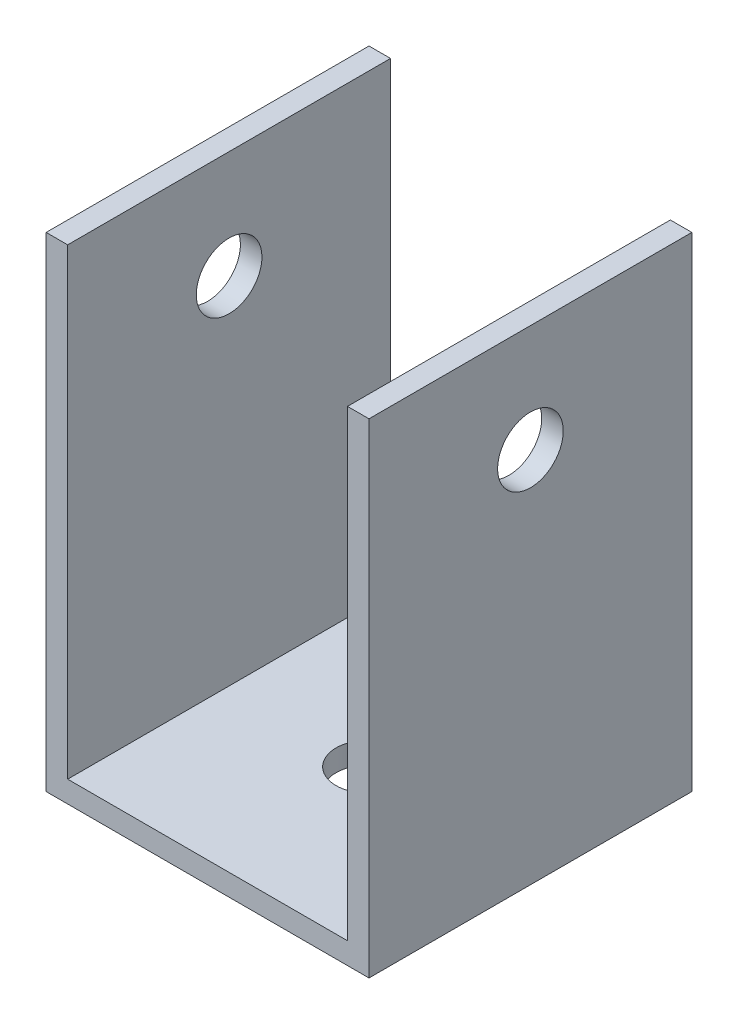
ISO-10303-21;
HEADER;
FILE_DESCRIPTION(('STEP AP214'),'2;1');
FILE_NAME('part.step','',(''),(''),'','','');
FILE_SCHEMA(('AUTOMOTIVE_DESIGN { 1 0 10303 214 1 1 1 1 }'));
ENDSEC;
DATA;
#1=APPLICATION_CONTEXT('core data for automotive mechanical design processes');
#2=APPLICATION_PROTOCOL_DEFINITION('international standard','automotive_design',2000,#1);
#3=PRODUCT_CONTEXT('',#1,'mechanical');
#4=PRODUCT('Part','Part','',(#3));
#5=PRODUCT_RELATED_PRODUCT_CATEGORY('part','',(#4));
#6=PRODUCT_DEFINITION_FORMATION('','',#4);
#7=PRODUCT_DEFINITION_CONTEXT('part definition',#1,'design');
#8=PRODUCT_DEFINITION('design','',#6,#7);
#9=PRODUCT_DEFINITION_SHAPE('','',#8);
#10=(LENGTH_UNIT() NAMED_UNIT(*) SI_UNIT(.MILLI.,.METRE.));
#11=(NAMED_UNIT(*) PLANE_ANGLE_UNIT() SI_UNIT($,.RADIAN.));
#12=(NAMED_UNIT(*) SI_UNIT($,.STERADIAN.) SOLID_ANGLE_UNIT());
#13=UNCERTAINTY_MEASURE_WITH_UNIT(LENGTH_MEASURE(1.E-05),#10,'distance_accuracy_value','');
#14=(GEOMETRIC_REPRESENTATION_CONTEXT(3) GLOBAL_UNCERTAINTY_ASSIGNED_CONTEXT((#13)) GLOBAL_UNIT_ASSIGNED_CONTEXT((#10,
#11,#12)) REPRESENTATION_CONTEXT('',''));
#15=CARTESIAN_POINT('',(0.,0.,0.));
#16=DIRECTION('',(0.,0.,1.));
#17=DIRECTION('',(1.,0.,0.));
#18=AXIS2_PLACEMENT_3D('',#15,#16,#17);
#19=CARTESIAN_POINT('',(-15.,37.7017613546896,30.));
#20=DIRECTION('',(1.,0.,0.));
#21=DIRECTION('',(0.,1.,0.));
#22=AXIS2_PLACEMENT_3D('',#19,#20,#21);
#23=PLANE('',#22);
#24=CARTESIAN_POINT('',(-15.,27.7017613546896,15.));
#25=DIRECTION('',(-1.,0.,0.));
#26=DIRECTION('',(0.,-1.,0.));
#27=AXIS2_PLACEMENT_3D('',#24,#25,#26);
#28=CIRCLE('',#27,3.05);
#29=CARTESIAN_POINT('',(-15.,24.6517613546896,15.));
#30=VERTEX_POINT('',#29);
#31=EDGE_CURVE('E217',#30,#30,#28,.T.);
#32=ORIENTED_EDGE('',*,*,#31,.F.);
#33=EDGE_LOOP('',(#32));
#34=FACE_BOUND('',#33,.T.);
#35=DIRECTION('',(0.,-1.,0.));
#36=VECTOR('',#35,1.);
#37=CARTESIAN_POINT('',(-15.,37.7017613546896,0.));
#38=LINE('',#37,#36);
#39=CARTESIAN_POINT('',(-15.,37.7017613546896,0.));
#40=VERTEX_POINT('',#39);
#41=CARTESIAN_POINT('',(-15.,-7.29823864531045,0.));
#42=VERTEX_POINT('',#41);
#43=EDGE_CURVE('E132',#40,#42,#38,.T.);
#44=ORIENTED_EDGE('',*,*,#43,.T.);
#45=DIRECTION('',(0.,0.,-1.));
#46=VECTOR('',#45,1.);
#47=CARTESIAN_POINT('',(-15.,-7.29823864531045,30.));
#48=LINE('',#47,#46);
#49=CARTESIAN_POINT('',(-15.,-7.29823864531045,30.));
#50=VERTEX_POINT('',#49);
#51=EDGE_CURVE('E11',#50,#42,#48,.T.);
#52=ORIENTED_EDGE('',*,*,#51,.F.);
#53=DIRECTION('',(0.,-1.,0.));
#54=VECTOR('',#53,1.);
#55=CARTESIAN_POINT('',(-15.,37.7017613546896,30.));
#56=LINE('',#55,#54);
#57=CARTESIAN_POINT('',(-15.,37.7017613546896,30.));
#58=VERTEX_POINT('',#57);
#59=EDGE_CURVE('E147',#58,#50,#56,.T.);
#60=ORIENTED_EDGE('',*,*,#59,.F.);
#61=DIRECTION('',(0.,0.,-1.));
#62=VECTOR('',#61,1.);
#63=CARTESIAN_POINT('',(-15.,37.7017613546896,30.));
#64=LINE('',#63,#62);
#65=EDGE_CURVE('E128',#58,#40,#64,.T.);
#66=ORIENTED_EDGE('',*,*,#65,.T.);
#67=EDGE_LOOP('',(#44,#52,#60,#66));
#68=FACE_BOUND('',#67,.T.);
#69=ADVANCED_FACE('F34',(#34,#68),#23,.F.);
#70=CARTESIAN_POINT('',(-15.,-7.29823864531045,30.));
#71=DIRECTION('',(0.,1.,0.));
#72=DIRECTION('',(-1.,0.,0.));
#73=AXIS2_PLACEMENT_3D('',#70,#71,#72);
#74=PLANE('',#73);
#75=CARTESIAN_POINT('',(0.,-7.29823864531045,15.));
#76=DIRECTION('',(0.,1.,0.));
#77=DIRECTION('',(-1.,0.,0.));
#78=AXIS2_PLACEMENT_3D('',#75,#76,#77);
#79=CIRCLE('',#78,3.05);
#80=CARTESIAN_POINT('',(-3.05,-7.29823864531045,15.));
#81=VERTEX_POINT('',#80);
#82=EDGE_CURVE('E136',#81,#81,#79,.T.);
#83=ORIENTED_EDGE('',*,*,#82,.T.);
#84=EDGE_LOOP('',(#83));
#85=FACE_BOUND('',#84,.T.);
#86=DIRECTION('',(1.,0.,0.));
#87=VECTOR('',#86,1.);
#88=CARTESIAN_POINT('',(-15.,-7.29823864531045,0.));
#89=LINE('',#88,#87);
#90=CARTESIAN_POINT('',(15.,-7.29823864531045,0.));
#91=VERTEX_POINT('',#90);
#92=EDGE_CURVE('E135',#42,#91,#89,.T.);
#93=ORIENTED_EDGE('',*,*,#92,.T.);
#94=DIRECTION('',(0.,0.,-1.));
#95=VECTOR('',#94,1.);
#96=CARTESIAN_POINT('',(15.,-7.29823864531045,30.));
#97=LINE('',#96,#95);
#98=CARTESIAN_POINT('',(15.,-7.29823864531045,30.));
#99=VERTEX_POINT('',#98);
#100=EDGE_CURVE('E43',#99,#91,#97,.T.);
#101=ORIENTED_EDGE('',*,*,#100,.F.);
#102=DIRECTION('',(1.,0.,0.));
#103=VECTOR('',#102,1.);
#104=CARTESIAN_POINT('',(-15.,-7.29823864531045,30.));
#105=LINE('',#104,#103);
#106=EDGE_CURVE('E95',#50,#99,#105,.T.);
#107=ORIENTED_EDGE('',*,*,#106,.F.);
#108=ORIENTED_EDGE('',*,*,#51,.T.);
#109=EDGE_LOOP('',(#93,#101,#107,#108));
#110=FACE_BOUND('',#109,.T.);
#111=ADVANCED_FACE('F208',(#85,#110),#74,.F.);
#112=CARTESIAN_POINT('',(15.,37.7017613546895,30.));
#113=DIRECTION('',(-1.,0.,0.));
#114=DIRECTION('',(0.,0.,1.));
#115=AXIS2_PLACEMENT_3D('',#112,#113,#114);
#116=PLANE('',#115);
#117=CARTESIAN_POINT('',(15.,27.7017613546895,15.));
#118=DIRECTION('',(-1.,0.,0.));
#119=DIRECTION('',(0.,0.,1.));
#120=AXIS2_PLACEMENT_3D('',#117,#118,#119);
#121=CIRCLE('',#120,3.05);
#122=CARTESIAN_POINT('',(15.,27.7017613546895,18.05));
#123=VERTEX_POINT('',#122);
#124=EDGE_CURVE('E160',#123,#123,#121,.T.);
#125=ORIENTED_EDGE('',*,*,#124,.T.);
#126=EDGE_LOOP('',(#125));
#127=FACE_BOUND('',#126,.T.);
#128=DIRECTION('',(0.,1.,0.));
#129=VECTOR('',#128,1.);
#130=CARTESIAN_POINT('',(15.,37.7017613546895,0.));
#131=LINE('',#130,#129);
#132=CARTESIAN_POINT('',(15.,37.7017613546895,0.));
#133=VERTEX_POINT('',#132);
#134=EDGE_CURVE('E138',#91,#133,#131,.T.);
#135=ORIENTED_EDGE('',*,*,#134,.T.);
#136=DIRECTION('',(0.,0.,-1.));
#137=VECTOR('',#136,1.);
#138=CARTESIAN_POINT('',(15.,37.7017613546895,30.));
#139=LINE('',#138,#137);
#140=CARTESIAN_POINT('',(15.,37.7017613546895,30.));
#141=VERTEX_POINT('',#140);
#142=EDGE_CURVE('E154',#141,#133,#139,.T.);
#143=ORIENTED_EDGE('',*,*,#142,.F.);
#144=DIRECTION('',(0.,1.,0.));
#145=VECTOR('',#144,1.);
#146=CARTESIAN_POINT('',(15.,37.7017613546895,30.));
#147=LINE('',#146,#145);
#148=EDGE_CURVE('E176',#99,#141,#147,.T.);
#149=ORIENTED_EDGE('',*,*,#148,.F.);
#150=ORIENTED_EDGE('',*,*,#100,.T.);
#151=EDGE_LOOP('',(#135,#143,#149,#150));
#152=FACE_BOUND('',#151,.T.);
#153=ADVANCED_FACE('F213',(#127,#152),#116,.F.);
#154=CARTESIAN_POINT('',(13.,37.7017613546896,30.));
#155=DIRECTION('',(0.,-1.,0.));
#156=DIRECTION('',(1.,0.,0.));
#157=AXIS2_PLACEMENT_3D('',#154,#155,#156);
#158=PLANE('',#157);
#159=DIRECTION('',(-1.,0.,0.));
#160=VECTOR('',#159,1.);
#161=CARTESIAN_POINT('',(13.,37.7017613546896,0.));
#162=LINE('',#161,#160);
#163=CARTESIAN_POINT('',(13.,37.7017613546896,0.));
#164=VERTEX_POINT('',#163);
#165=EDGE_CURVE('E140',#133,#164,#162,.T.);
#166=ORIENTED_EDGE('',*,*,#165,.T.);
#167=DIRECTION('',(0.,0.,-1.));
#168=VECTOR('',#167,1.);
#169=CARTESIAN_POINT('',(13.,37.7017613546896,30.));
#170=LINE('',#169,#168);
#171=CARTESIAN_POINT('',(13.,37.7017613546896,30.));
#172=VERTEX_POINT('',#171);
#173=EDGE_CURVE('E151',#172,#164,#170,.T.);
#174=ORIENTED_EDGE('',*,*,#173,.F.);
#175=DIRECTION('',(-1.,0.,0.));
#176=VECTOR('',#175,1.);
#177=CARTESIAN_POINT('',(13.,37.7017613546896,30.));
#178=LINE('',#177,#176);
#179=EDGE_CURVE('E178',#141,#172,#178,.T.);
#180=ORIENTED_EDGE('',*,*,#179,.F.);
#181=ORIENTED_EDGE('',*,*,#142,.T.);
#182=EDGE_LOOP('',(#166,#174,#180,#181));
#183=FACE_BOUND('',#182,.T.);
#184=ADVANCED_FACE('F184',(#183),#158,.F.);
#185=CARTESIAN_POINT('',(13.,-5.29823864531045,30.));
#186=DIRECTION('',(1.,0.,0.));
#187=DIRECTION('',(0.,1.,0.));
#188=AXIS2_PLACEMENT_3D('',#185,#186,#187);
#189=PLANE('',#188);
#190=CARTESIAN_POINT('',(13.,27.7017613546895,15.));
#191=DIRECTION('',(1.,0.,0.));
#192=DIRECTION('',(0.,1.,0.));
#193=AXIS2_PLACEMENT_3D('',#190,#191,#192);
#194=CIRCLE('',#193,3.05);
#195=CARTESIAN_POINT('',(13.,30.7517613546895,15.));
#196=VERTEX_POINT('',#195);
#197=EDGE_CURVE('E166',#196,#196,#194,.T.);
#198=ORIENTED_EDGE('',*,*,#197,.T.);
#199=EDGE_LOOP('',(#198));
#200=FACE_BOUND('',#199,.T.);
#201=DIRECTION('',(0.,-1.,0.));
#202=VECTOR('',#201,1.);
#203=CARTESIAN_POINT('',(13.,-5.29823864531045,0.));
#204=LINE('',#203,#202);
#205=CARTESIAN_POINT('',(13.,-5.29823864531045,0.));
#206=VERTEX_POINT('',#205);
#207=EDGE_CURVE('E142',#164,#206,#204,.T.);
#208=ORIENTED_EDGE('',*,*,#207,.T.);
#209=DIRECTION('',(0.,0.,-1.));
#210=VECTOR('',#209,1.);
#211=CARTESIAN_POINT('',(13.,-5.29823864531045,30.));
#212=LINE('',#211,#210);
#213=CARTESIAN_POINT('',(13.,-5.29823864531045,30.));
#214=VERTEX_POINT('',#213);
#215=EDGE_CURVE('E123',#214,#206,#212,.T.);
#216=ORIENTED_EDGE('',*,*,#215,.F.);
#217=DIRECTION('',(0.,-1.,0.));
#218=VECTOR('',#217,1.);
#219=CARTESIAN_POINT('',(13.,-5.29823864531045,30.));
#220=LINE('',#219,#218);
#221=EDGE_CURVE('E114',#172,#214,#220,.T.);
#222=ORIENTED_EDGE('',*,*,#221,.F.);
#223=ORIENTED_EDGE('',*,*,#173,.T.);
#224=EDGE_LOOP('',(#208,#216,#222,#223));
#225=FACE_BOUND('',#224,.T.);
#226=ADVANCED_FACE('F188',(#200,#225),#189,.F.);
#227=CARTESIAN_POINT('',(-13.,-5.29823864531045,30.));
#228=DIRECTION('',(0.,-1.,0.));
#229=DIRECTION('',(1.,0.,0.));
#230=AXIS2_PLACEMENT_3D('',#227,#228,#229);
#231=PLANE('',#230);
#232=CARTESIAN_POINT('',(0.,-5.29823864531045,15.));
#233=DIRECTION('',(0.,-1.,0.));
#234=DIRECTION('',(1.,0.,0.));
#235=AXIS2_PLACEMENT_3D('',#232,#233,#234);
#236=CIRCLE('',#235,3.05);
#237=CARTESIAN_POINT('',(3.05,-5.29823864531045,15.));
#238=VERTEX_POINT('',#237);
#239=EDGE_CURVE('E158',#238,#238,#236,.T.);
#240=ORIENTED_EDGE('',*,*,#239,.T.);
#241=EDGE_LOOP('',(#240));
#242=FACE_BOUND('',#241,.T.);
#243=DIRECTION('',(-1.,0.,0.));
#244=VECTOR('',#243,1.);
#245=CARTESIAN_POINT('',(-13.,-5.29823864531045,0.));
#246=LINE('',#245,#244);
#247=CARTESIAN_POINT('',(-13.,-5.29823864531045,0.));
#248=VERTEX_POINT('',#247);
#249=EDGE_CURVE('E122',#206,#248,#246,.T.);
#250=ORIENTED_EDGE('',*,*,#249,.T.);
#251=DIRECTION('',(0.,0.,-1.));
#252=VECTOR('',#251,1.);
#253=CARTESIAN_POINT('',(-13.,-5.29823864531045,30.));
#254=LINE('',#253,#252);
#255=CARTESIAN_POINT('',(-13.,-5.29823864531045,30.));
#256=VERTEX_POINT('',#255);
#257=EDGE_CURVE('E119',#256,#248,#254,.T.);
#258=ORIENTED_EDGE('',*,*,#257,.F.);
#259=DIRECTION('',(-1.,0.,0.));
#260=VECTOR('',#259,1.);
#261=CARTESIAN_POINT('',(-13.,-5.29823864531045,30.));
#262=LINE('',#261,#260);
#263=EDGE_CURVE('E108',#214,#256,#262,.T.);
#264=ORIENTED_EDGE('',*,*,#263,.F.);
#265=ORIENTED_EDGE('',*,*,#215,.T.);
#266=EDGE_LOOP('',(#250,#258,#264,#265));
#267=FACE_BOUND('',#266,.T.);
#268=ADVANCED_FACE('F120',(#242,#267),#231,.F.);
#269=CARTESIAN_POINT('',(-13.,37.7017613546896,30.));
#270=DIRECTION('',(-1.,0.,0.));
#271=DIRECTION('',(0.,-1.,0.));
#272=AXIS2_PLACEMENT_3D('',#269,#270,#271);
#273=PLANE('',#272);
#274=CARTESIAN_POINT('',(-13.,27.7017613546896,15.));
#275=DIRECTION('',(-1.,0.,0.));
#276=DIRECTION('',(0.,-1.,0.));
#277=AXIS2_PLACEMENT_3D('',#274,#275,#276);
#278=CIRCLE('',#277,3.05);
#279=CARTESIAN_POINT('',(-13.,24.6517613546896,15.));
#280=VERTEX_POINT('',#279);
#281=EDGE_CURVE('E37',#280,#280,#278,.T.);
#282=ORIENTED_EDGE('',*,*,#281,.T.);
#283=EDGE_LOOP('',(#282));
#284=FACE_BOUND('',#283,.T.);
#285=DIRECTION('',(0.,1.,0.));
#286=VECTOR('',#285,1.);
#287=CARTESIAN_POINT('',(-13.,37.7017613546896,0.));
#288=LINE('',#287,#286);
#289=CARTESIAN_POINT('',(-13.,37.7017613546896,0.));
#290=VERTEX_POINT('',#289);
#291=EDGE_CURVE('E81',#248,#290,#288,.T.);
#292=ORIENTED_EDGE('',*,*,#291,.T.);
#293=DIRECTION('',(0.,0.,-1.));
#294=VECTOR('',#293,1.);
#295=CARTESIAN_POINT('',(-13.,37.7017613546896,30.));
#296=LINE('',#295,#294);
#297=CARTESIAN_POINT('',(-13.,37.7017613546896,30.));
#298=VERTEX_POINT('',#297);
#299=EDGE_CURVE('E124',#298,#290,#296,.T.);
#300=ORIENTED_EDGE('',*,*,#299,.F.);
#301=DIRECTION('',(0.,1.,0.));
#302=VECTOR('',#301,1.);
#303=CARTESIAN_POINT('',(-13.,37.7017613546896,30.));
#304=LINE('',#303,#302);
#305=EDGE_CURVE('E112',#256,#298,#304,.T.);
#306=ORIENTED_EDGE('',*,*,#305,.F.);
#307=ORIENTED_EDGE('',*,*,#257,.T.);
#308=EDGE_LOOP('',(#292,#300,#306,#307));
#309=FACE_BOUND('',#308,.T.);
#310=ADVANCED_FACE('F126',(#284,#309),#273,.F.);
#311=CARTESIAN_POINT('',(-15.,37.7017613546896,30.));
#312=DIRECTION('',(0.,-1.,0.));
#313=DIRECTION('',(1.,0.,0.));
#314=AXIS2_PLACEMENT_3D('',#311,#312,#313);
#315=PLANE('',#314);
#316=DIRECTION('',(-1.,0.,0.));
#317=VECTOR('',#316,1.);
#318=CARTESIAN_POINT('',(-15.,37.7017613546896,0.));
#319=LINE('',#318,#317);
#320=EDGE_CURVE('E87',#290,#40,#319,.T.);
#321=ORIENTED_EDGE('',*,*,#320,.T.);
#322=ORIENTED_EDGE('',*,*,#65,.F.);
#323=DIRECTION('',(-1.,0.,0.));
#324=VECTOR('',#323,1.);
#325=CARTESIAN_POINT('',(-15.,37.7017613546896,30.));
#326=LINE('',#325,#324);
#327=EDGE_CURVE('E52',#298,#58,#326,.T.);
#328=ORIENTED_EDGE('',*,*,#327,.F.);
#329=ORIENTED_EDGE('',*,*,#299,.T.);
#330=EDGE_LOOP('',(#321,#322,#328,#329));
#331=FACE_BOUND('',#330,.T.);
#332=ADVANCED_FACE('F196',(#331),#315,.F.);
#333=CARTESIAN_POINT('',(0.,0.,30.));
#334=DIRECTION('',(0.,0.,1.));
#335=DIRECTION('',(1.,0.,0.));
#336=AXIS2_PLACEMENT_3D('',#333,#334,#335);
#337=PLANE('',#336);
#338=ORIENTED_EDGE('',*,*,#59,.T.);
#339=ORIENTED_EDGE('',*,*,#106,.T.);
#340=ORIENTED_EDGE('',*,*,#148,.T.);
#341=ORIENTED_EDGE('',*,*,#179,.T.);
#342=ORIENTED_EDGE('',*,*,#221,.T.);
#343=ORIENTED_EDGE('',*,*,#263,.T.);
#344=ORIENTED_EDGE('',*,*,#305,.T.);
#345=ORIENTED_EDGE('',*,*,#327,.T.);
#346=EDGE_LOOP('',(#338,#339,#340,#341,#342,#343,#344,#345));
#347=FACE_BOUND('',#346,.T.);
#348=ADVANCED_FACE('F110',(#347),#337,.T.);
#349=CARTESIAN_POINT('',(0.,0.,0.));
#350=DIRECTION('',(0.,0.,1.));
#351=DIRECTION('',(1.,0.,0.));
#352=AXIS2_PLACEMENT_3D('',#349,#350,#351);
#353=PLANE('',#352);
#354=ORIENTED_EDGE('',*,*,#43,.F.);
#355=ORIENTED_EDGE('',*,*,#320,.F.);
#356=ORIENTED_EDGE('',*,*,#291,.F.);
#357=ORIENTED_EDGE('',*,*,#249,.F.);
#358=ORIENTED_EDGE('',*,*,#207,.F.);
#359=ORIENTED_EDGE('',*,*,#165,.F.);
#360=ORIENTED_EDGE('',*,*,#134,.F.);
#361=ORIENTED_EDGE('',*,*,#92,.F.);
#362=EDGE_LOOP('',(#354,#355,#356,#357,#358,#359,#360,#361));
#363=FACE_BOUND('',#362,.T.);
#364=ADVANCED_FACE('F191',(#363),#353,.F.);
#365=CARTESIAN_POINT('',(0.,-30.,15.));
#366=DIRECTION('',(0.,1.,0.));
#367=DIRECTION('',(0.,0.,1.));
#368=AXIS2_PLACEMENT_3D('',#365,#366,#367);
#369=CYLINDRICAL_SURFACE('',#368,3.05);
#370=ORIENTED_EDGE('',*,*,#239,.F.);
#371=EDGE_LOOP('',(#370));
#372=FACE_BOUND('',#371,.T.);
#373=ORIENTED_EDGE('',*,*,#82,.F.);
#374=EDGE_LOOP('',(#373));
#375=FACE_BOUND('',#374,.T.);
#376=ADVANCED_FACE('F225',(#372,#375),#369,.F.);
#377=CARTESIAN_POINT('',(23.,27.7017613546895,15.));
#378=DIRECTION('',(-1.,0.,0.));
#379=DIRECTION('',(0.,-1.,0.));
#380=AXIS2_PLACEMENT_3D('',#377,#378,#379);
#381=CYLINDRICAL_SURFACE('',#380,3.05);
#382=ORIENTED_EDGE('',*,*,#31,.T.);
#383=EDGE_LOOP('',(#382));
#384=FACE_BOUND('',#383,.T.);
#385=ORIENTED_EDGE('',*,*,#281,.F.);
#386=EDGE_LOOP('',(#385));
#387=FACE_BOUND('',#386,.T.);
#388=ADVANCED_FACE('F222',(#384,#387),#381,.F.);
#389=ORIENTED_EDGE('',*,*,#197,.F.);
#390=EDGE_LOOP('',(#389));
#391=FACE_BOUND('',#390,.T.);
#392=ORIENTED_EDGE('',*,*,#124,.F.);
#393=EDGE_LOOP('',(#392));
#394=FACE_BOUND('',#393,.T.);
#395=ADVANCED_FACE('F224',(#391,#394),#381,.F.);
#396=CLOSED_SHELL('',(#69,#111,#153,#184,#226,#268,#310,#332,#348,#364,#376,#388,#395));
#397=MANIFOLD_SOLID_BREP('B2',#396);
#398=ADVANCED_BREP_SHAPE_REPRESENTATION('',(#18,#397),#14);
#399=SHAPE_DEFINITION_REPRESENTATION(#9,#398);
ENDSEC;
END-ISO-10303-21;
